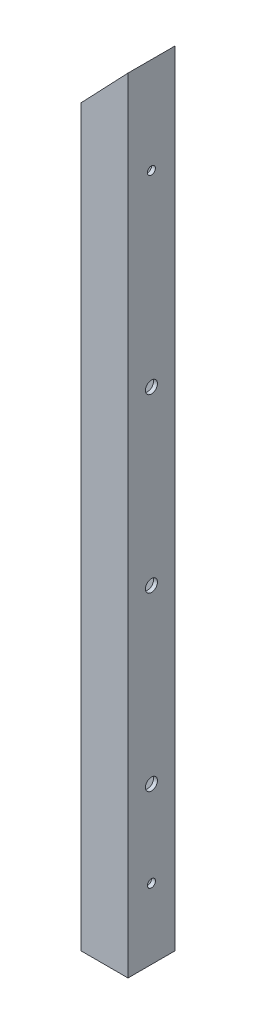
ISO-10303-21;
HEADER;
FILE_DESCRIPTION(('STEP AP214'),'2;1');
FILE_NAME('part.step','',(''),(''),'','','');
FILE_SCHEMA(('AUTOMOTIVE_DESIGN { 1 0 10303 214 1 1 1 1 }'));
ENDSEC;
DATA;
#1=APPLICATION_CONTEXT('core data for automotive mechanical design processes');
#2=APPLICATION_PROTOCOL_DEFINITION('international standard','automotive_design',2000,#1);
#3=PRODUCT_CONTEXT('',#1,'mechanical');
#4=PRODUCT('Part','Part','',(#3));
#5=PRODUCT_RELATED_PRODUCT_CATEGORY('part','',(#4));
#6=PRODUCT_DEFINITION_FORMATION('','',#4);
#7=PRODUCT_DEFINITION_CONTEXT('part definition',#1,'design');
#8=PRODUCT_DEFINITION('design','',#6,#7);
#9=PRODUCT_DEFINITION_SHAPE('','',#8);
#10=(LENGTH_UNIT() NAMED_UNIT(*) SI_UNIT(.MILLI.,.METRE.));
#11=(NAMED_UNIT(*) PLANE_ANGLE_UNIT() SI_UNIT($,.RADIAN.));
#12=(NAMED_UNIT(*) SI_UNIT($,.STERADIAN.) SOLID_ANGLE_UNIT());
#13=UNCERTAINTY_MEASURE_WITH_UNIT(LENGTH_MEASURE(1.E-05),#10,'distance_accuracy_value','');
#14=(GEOMETRIC_REPRESENTATION_CONTEXT(3) GLOBAL_UNCERTAINTY_ASSIGNED_CONTEXT((#13)) GLOBAL_UNIT_ASSIGNED_CONTEXT((#10,
#11,#12)) REPRESENTATION_CONTEXT('',''));
#15=CARTESIAN_POINT('',(0.,0.,0.));
#16=DIRECTION('',(0.,0.,1.));
#17=DIRECTION('',(1.,0.,0.));
#18=AXIS2_PLACEMENT_3D('',#15,#16,#17);
#19=CARTESIAN_POINT('',(-698.5,596.9,-38.1));
#20=DIRECTION('',(1.,0.,0.));
#21=DIRECTION('',(0.,1.,0.));
#22=AXIS2_PLACEMENT_3D('',#19,#20,#21);
#23=PLANE('',#22);
#24=CARTESIAN_POINT('',(-698.5,57.15,-19.05));
#25=DIRECTION('',(1.,0.,0.));
#26=DIRECTION('',(0.,0.,-1.));
#27=AXIS2_PLACEMENT_3D('',#24,#25,#26);
#28=CIRCLE('',#27,3.26389999999966);
#29=CARTESIAN_POINT('',(-698.5,57.15,-22.3138999999997));
#30=VERTEX_POINT('',#29);
#31=EDGE_CURVE('E253',#30,#30,#28,.T.);
#32=ORIENTED_EDGE('',*,*,#31,.T.);
#33=EDGE_LOOP('',(#32));
#34=FACE_BOUND('',#33,.T.);
#35=CARTESIAN_POINT('',(-698.5,558.8,-19.05));
#36=DIRECTION('',(1.,0.,0.));
#37=DIRECTION('',(0.,0.,-1.));
#38=AXIS2_PLACEMENT_3D('',#35,#36,#37);
#39=CIRCLE('',#38,3.26389999999965);
#40=CARTESIAN_POINT('',(-698.5,558.8,-22.3138999999997));
#41=VERTEX_POINT('',#40);
#42=EDGE_CURVE('E151',#41,#41,#39,.T.);
#43=ORIENTED_EDGE('',*,*,#42,.T.);
#44=EDGE_LOOP('',(#43));
#45=FACE_BOUND('',#44,.T.);
#46=CARTESIAN_POINT('',(-698.5,127.,-19.05));
#47=DIRECTION('',(1.,0.,0.));
#48=DIRECTION('',(0.,0.,-1.));
#49=AXIS2_PLACEMENT_3D('',#46,#47,#48);
#50=CIRCLE('',#49,4.90219999999966);
#51=CARTESIAN_POINT('',(-698.5,127.,-23.9521999999997));
#52=VERTEX_POINT('',#51);
#53=EDGE_CURVE('E169',#52,#52,#50,.T.);
#54=ORIENTED_EDGE('',*,*,#53,.T.);
#55=EDGE_LOOP('',(#54));
#56=FACE_BOUND('',#55,.T.);
#57=CARTESIAN_POINT('',(-698.5,406.4,-19.05));
#58=DIRECTION('',(1.,0.,0.));
#59=DIRECTION('',(0.,0.,-1.));
#60=AXIS2_PLACEMENT_3D('',#57,#58,#59);
#61=CIRCLE('',#60,4.90219999999963);
#62=CARTESIAN_POINT('',(-698.5,406.4,-23.9521999999996));
#63=VERTEX_POINT('',#62);
#64=EDGE_CURVE('E147',#63,#63,#61,.T.);
#65=ORIENTED_EDGE('',*,*,#64,.T.);
#66=EDGE_LOOP('',(#65));
#67=FACE_BOUND('',#66,.T.);
#68=CARTESIAN_POINT('',(-698.5,266.7,-19.05));
#69=DIRECTION('',(1.,0.,0.));
#70=DIRECTION('',(0.,0.,-1.));
#71=AXIS2_PLACEMENT_3D('',#68,#69,#70);
#72=CIRCLE('',#71,4.90219999999963);
#73=CARTESIAN_POINT('',(-698.5,266.7,-23.9521999999996));
#74=VERTEX_POINT('',#73);
#75=EDGE_CURVE('E143',#74,#74,#72,.T.);
#76=ORIENTED_EDGE('',*,*,#75,.T.);
#77=EDGE_LOOP('',(#76));
#78=FACE_BOUND('',#77,.T.);
#79=DIRECTION('',(0.,0.,-1.));
#80=VECTOR('',#79,1.);
#81=CARTESIAN_POINT('',(-698.5,-2.22044604925031E-13,-38.1));
#82=LINE('',#81,#80);
#83=CARTESIAN_POINT('',(-698.5,-2.22044604925031E-13,0.));
#84=VERTEX_POINT('',#83);
#85=CARTESIAN_POINT('',(-698.5,-2.22044604925031E-13,-38.1));
#86=VERTEX_POINT('',#85);
#87=EDGE_CURVE('E112',#84,#86,#82,.T.);
#88=ORIENTED_EDGE('',*,*,#87,.F.);
#89=DIRECTION('',(0.,-1.,0.));
#90=VECTOR('',#89,1.);
#91=CARTESIAN_POINT('',(-698.5,596.9,0.));
#92=LINE('',#91,#90);
#93=CARTESIAN_POINT('',(-698.5,596.9,0.));
#94=VERTEX_POINT('',#93);
#95=EDGE_CURVE('E49',#94,#84,#92,.T.);
#96=ORIENTED_EDGE('',*,*,#95,.F.);
#97=DIRECTION('',(0.,0.,1.));
#98=VECTOR('',#97,1.);
#99=CARTESIAN_POINT('',(-698.5,596.9,-38.1));
#100=LINE('',#99,#98);
#101=CARTESIAN_POINT('',(-698.5,596.9,-38.1));
#102=VERTEX_POINT('',#101);
#103=EDGE_CURVE('E124',#102,#94,#100,.T.);
#104=ORIENTED_EDGE('',*,*,#103,.F.);
#105=DIRECTION('',(0.,-1.,0.));
#106=VECTOR('',#105,1.);
#107=CARTESIAN_POINT('',(-698.5,596.9,-38.1));
#108=LINE('',#107,#106);
#109=EDGE_CURVE('E131',#102,#86,#108,.T.);
#110=ORIENTED_EDGE('',*,*,#109,.T.);
#111=EDGE_LOOP('',(#88,#96,#104,#110));
#112=FACE_BOUND('',#111,.T.);
#113=ADVANCED_FACE('F33',(#34,#45,#56,#67,#78,#112),#23,.F.);
#114=CARTESIAN_POINT('',(-660.4,596.9,0.));
#115=DIRECTION('',(0.,0.,-1.));
#116=DIRECTION('',(-1.,0.,0.));
#117=AXIS2_PLACEMENT_3D('',#114,#115,#116);
#118=PLANE('',#117);
#119=DIRECTION('',(-1.,0.,0.));
#120=VECTOR('',#119,1.);
#121=CARTESIAN_POINT('',(-660.4,-2.22044604925031E-13,0.));
#122=LINE('',#121,#120);
#123=CARTESIAN_POINT('',(-660.4,-2.22044604925031E-13,0.));
#124=VERTEX_POINT('',#123);
#125=EDGE_CURVE('E199',#124,#84,#122,.T.);
#126=ORIENTED_EDGE('',*,*,#125,.F.);
#127=DIRECTION('',(0.,-1.,0.));
#128=VECTOR('',#127,1.);
#129=CARTESIAN_POINT('',(-660.4,596.9,0.));
#130=LINE('',#129,#128);
#131=CARTESIAN_POINT('',(-660.4,636.843548387097,0.));
#132=VERTEX_POINT('',#131);
#133=EDGE_CURVE('E121',#132,#124,#130,.T.);
#134=ORIENTED_EDGE('',*,*,#133,.F.);
#135=DIRECTION('',(0.690210929016375,0.723608232033296,0.));
#136=VECTOR('',#135,1.);
#137=CARTESIAN_POINT('',(-680.349498079068,615.92875201388,0.));
#138=LINE('',#137,#136);
#139=EDGE_CURVE('E220',#94,#132,#138,.T.);
#140=ORIENTED_EDGE('',*,*,#139,.F.);
#141=ORIENTED_EDGE('',*,*,#95,.T.);
#142=EDGE_LOOP('',(#126,#134,#140,#141));
#143=FACE_BOUND('',#142,.T.);
#144=ADVANCED_FACE('F230',(#143),#118,.F.);
#145=CARTESIAN_POINT('',(-660.4,596.9,-38.1));
#146=DIRECTION('',(-1.,0.,0.));
#147=DIRECTION('',(0.,-1.,0.));
#148=AXIS2_PLACEMENT_3D('',#145,#146,#147);
#149=PLANE('',#148);
#150=CARTESIAN_POINT('',(-660.4,57.15,-19.05));
#151=DIRECTION('',(-1.,0.,0.));
#152=DIRECTION('',(0.,-1.,0.));
#153=AXIS2_PLACEMENT_3D('',#150,#151,#152);
#154=CIRCLE('',#153,3.26389999999974);
#155=CARTESIAN_POINT('',(-660.4,53.8861000000003,-19.05));
#156=VERTEX_POINT('',#155);
#157=EDGE_CURVE('E36',#156,#156,#154,.T.);
#158=ORIENTED_EDGE('',*,*,#157,.T.);
#159=EDGE_LOOP('',(#158));
#160=FACE_BOUND('',#159,.T.);
#161=CARTESIAN_POINT('',(-660.4,558.8,-19.05));
#162=DIRECTION('',(-1.,0.,0.));
#163=DIRECTION('',(0.,-1.,0.));
#164=AXIS2_PLACEMENT_3D('',#161,#162,#163);
#165=CIRCLE('',#164,3.26389999999976);
#166=CARTESIAN_POINT('',(-660.4,555.5361,-19.05));
#167=VERTEX_POINT('',#166);
#168=EDGE_CURVE('E155',#167,#167,#165,.T.);
#169=ORIENTED_EDGE('',*,*,#168,.T.);
#170=EDGE_LOOP('',(#169));
#171=FACE_BOUND('',#170,.T.);
#172=CARTESIAN_POINT('',(-660.4,127.,-19.05));
#173=DIRECTION('',(-1.,0.,0.));
#174=DIRECTION('',(0.,-1.,0.));
#175=AXIS2_PLACEMENT_3D('',#172,#173,#174);
#176=CIRCLE('',#175,4.90219999999975);
#177=CARTESIAN_POINT('',(-660.4,122.0978,-19.05));
#178=VERTEX_POINT('',#177);
#179=EDGE_CURVE('E172',#178,#178,#176,.T.);
#180=ORIENTED_EDGE('',*,*,#179,.T.);
#181=EDGE_LOOP('',(#180));
#182=FACE_BOUND('',#181,.T.);
#183=CARTESIAN_POINT('',(-660.4,406.4,-19.05));
#184=DIRECTION('',(-1.,0.,0.));
#185=DIRECTION('',(0.,-1.,0.));
#186=AXIS2_PLACEMENT_3D('',#183,#184,#185);
#187=CIRCLE('',#186,4.90219999999975);
#188=CARTESIAN_POINT('',(-660.4,401.4978,-19.05));
#189=VERTEX_POINT('',#188);
#190=EDGE_CURVE('E185',#189,#189,#187,.T.);
#191=ORIENTED_EDGE('',*,*,#190,.T.);
#192=EDGE_LOOP('',(#191));
#193=FACE_BOUND('',#192,.T.);
#194=CARTESIAN_POINT('',(-660.4,266.7,-19.05));
#195=DIRECTION('',(-1.,0.,0.));
#196=DIRECTION('',(0.,-1.,0.));
#197=AXIS2_PLACEMENT_3D('',#194,#195,#196);
#198=CIRCLE('',#197,4.90219999999972);
#199=CARTESIAN_POINT('',(-660.4,261.7978,-19.05));
#200=VERTEX_POINT('',#199);
#201=EDGE_CURVE('E192',#200,#200,#198,.T.);
#202=ORIENTED_EDGE('',*,*,#201,.T.);
#203=EDGE_LOOP('',(#202));
#204=FACE_BOUND('',#203,.T.);
#205=DIRECTION('',(0.,0.,1.));
#206=VECTOR('',#205,1.);
#207=CARTESIAN_POINT('',(-660.4,-2.22044604925031E-13,-38.1));
#208=LINE('',#207,#206);
#209=CARTESIAN_POINT('',(-660.4,-2.22044604925031E-13,-38.1));
#210=VERTEX_POINT('',#209);
#211=EDGE_CURVE('E202',#210,#124,#208,.T.);
#212=ORIENTED_EDGE('',*,*,#211,.F.);
#213=DIRECTION('',(0.,-1.,0.));
#214=VECTOR('',#213,1.);
#215=CARTESIAN_POINT('',(-660.4,596.9,-38.1));
#216=LINE('',#215,#214);
#217=CARTESIAN_POINT('',(-660.4,636.843548387097,-38.1));
#218=VERTEX_POINT('',#217);
#219=EDGE_CURVE('E133',#218,#210,#216,.T.);
#220=ORIENTED_EDGE('',*,*,#219,.F.);
#221=DIRECTION('',(0.,0.,-1.));
#222=VECTOR('',#221,1.);
#223=CARTESIAN_POINT('',(-660.4,636.843548387097,-38.1));
#224=LINE('',#223,#222);
#225=EDGE_CURVE('E218',#132,#218,#224,.T.);
#226=ORIENTED_EDGE('',*,*,#225,.F.);
#227=ORIENTED_EDGE('',*,*,#133,.T.);
#228=EDGE_LOOP('',(#212,#220,#226,#227));
#229=FACE_BOUND('',#228,.T.);
#230=ADVANCED_FACE('F232',(#160,#171,#182,#193,#204,#229),#149,.F.);
#231=CARTESIAN_POINT('',(-660.4,596.9,-38.1));
#232=DIRECTION('',(0.,0.,1.));
#233=DIRECTION('',(1.,0.,0.));
#234=AXIS2_PLACEMENT_3D('',#231,#232,#233);
#235=PLANE('',#234);
#236=DIRECTION('',(1.,0.,0.));
#237=VECTOR('',#236,1.);
#238=CARTESIAN_POINT('',(-660.4,-2.22044604925031E-13,-38.1));
#239=LINE('',#238,#237);
#240=EDGE_CURVE('E205',#86,#210,#239,.T.);
#241=ORIENTED_EDGE('',*,*,#240,.F.);
#242=ORIENTED_EDGE('',*,*,#109,.F.);
#243=DIRECTION('',(-0.690210929016375,-0.723608232033296,0.));
#244=VECTOR('',#243,1.);
#245=CARTESIAN_POINT('',(-680.349498079068,615.92875201388,-38.1));
#246=LINE('',#245,#244);
#247=EDGE_CURVE('E215',#218,#102,#246,.T.);
#248=ORIENTED_EDGE('',*,*,#247,.F.);
#249=ORIENTED_EDGE('',*,*,#219,.T.);
#250=EDGE_LOOP('',(#241,#242,#248,#249));
#251=FACE_BOUND('',#250,.T.);
#252=ADVANCED_FACE('F234',(#251),#235,.F.);
#253=CARTESIAN_POINT('',(-698.5,596.9,-38.1));
#254=DIRECTION('',(-0.723608232033296,0.690210929016375,0.));
#255=DIRECTION('',(-0.690210929016375,-0.723608232033296,0.));
#256=AXIS2_PLACEMENT_3D('',#253,#254,#255);
#257=PLANE('',#256);
#258=DIRECTION('',(0.,0.,1.));
#259=VECTOR('',#258,1.);
#260=CARTESIAN_POINT('',(-695.325,600.228629032258,-34.925));
#261=LINE('',#260,#259);
#262=CARTESIAN_POINT('',(-695.325,600.228629032258,-34.925));
#263=VERTEX_POINT('',#262);
#264=CARTESIAN_POINT('',(-695.325,600.228629032258,-3.175));
#265=VERTEX_POINT('',#264);
#266=EDGE_CURVE('E117',#263,#265,#261,.T.);
#267=ORIENTED_EDGE('',*,*,#266,.F.);
#268=DIRECTION('',(-0.690210929016375,-0.723608232033296,0.));
#269=VECTOR('',#268,1.);
#270=CARTESIAN_POINT('',(-681.862039905812,614.34302267939,-34.925));
#271=LINE('',#270,#269);
#272=CARTESIAN_POINT('',(-663.575,633.514919354839,-34.925));
#273=VERTEX_POINT('',#272);
#274=EDGE_CURVE('E211',#273,#263,#271,.T.);
#275=ORIENTED_EDGE('',*,*,#274,.F.);
#276=DIRECTION('',(0.,0.,-1.));
#277=VECTOR('',#276,1.);
#278=CARTESIAN_POINT('',(-663.575,633.514919354839,-34.925));
#279=LINE('',#278,#277);
#280=CARTESIAN_POINT('',(-663.575,633.514919354839,-3.175));
#281=VERTEX_POINT('',#280);
#282=EDGE_CURVE('E208',#281,#273,#279,.T.);
#283=ORIENTED_EDGE('',*,*,#282,.F.);
#284=DIRECTION('',(0.690210929016375,0.723608232033296,0.));
#285=VECTOR('',#284,1.);
#286=CARTESIAN_POINT('',(-681.862039905812,614.34302267939,-3.175));
#287=LINE('',#286,#285);
#288=EDGE_CURVE('E41',#265,#281,#287,.T.);
#289=ORIENTED_EDGE('',*,*,#288,.F.);
#290=EDGE_LOOP('',(#267,#275,#283,#289));
#291=FACE_BOUND('',#290,.T.);
#292=ORIENTED_EDGE('',*,*,#247,.T.);
#293=ORIENTED_EDGE('',*,*,#103,.T.);
#294=ORIENTED_EDGE('',*,*,#139,.T.);
#295=ORIENTED_EDGE('',*,*,#225,.T.);
#296=EDGE_LOOP('',(#292,#293,#294,#295));
#297=FACE_BOUND('',#296,.T.);
#298=ADVANCED_FACE('F225',(#291,#297),#257,.T.);
#299=CARTESIAN_POINT('',(-695.325,596.9,-34.925));
#300=DIRECTION('',(1.,0.,0.));
#301=DIRECTION('',(0.,1.,0.));
#302=AXIS2_PLACEMENT_3D('',#299,#300,#301);
#303=PLANE('',#302);
#304=CARTESIAN_POINT('',(-695.325,57.15,-19.05));
#305=DIRECTION('',(1.,0.,0.));
#306=DIRECTION('',(0.,1.,0.));
#307=AXIS2_PLACEMENT_3D('',#304,#305,#306);
#308=CIRCLE('',#307,3.26389999999974);
#309=CARTESIAN_POINT('',(-695.325,60.4138999999997,-19.05));
#310=VERTEX_POINT('',#309);
#311=EDGE_CURVE('E163',#310,#310,#308,.T.);
#312=ORIENTED_EDGE('',*,*,#311,.F.);
#313=EDGE_LOOP('',(#312));
#314=FACE_BOUND('',#313,.T.);
#315=CARTESIAN_POINT('',(-695.325,558.8,-19.05));
#316=DIRECTION('',(1.,0.,0.));
#317=DIRECTION('',(0.,1.,0.));
#318=AXIS2_PLACEMENT_3D('',#315,#316,#317);
#319=CIRCLE('',#318,3.26389999999976);
#320=CARTESIAN_POINT('',(-695.325,562.0639,-19.05));
#321=VERTEX_POINT('',#320);
#322=EDGE_CURVE('E150',#321,#321,#319,.T.);
#323=ORIENTED_EDGE('',*,*,#322,.F.);
#324=EDGE_LOOP('',(#323));
#325=FACE_BOUND('',#324,.T.);
#326=CARTESIAN_POINT('',(-695.325,127.,-19.05));
#327=DIRECTION('',(1.,0.,0.));
#328=DIRECTION('',(0.,1.,0.));
#329=AXIS2_PLACEMENT_3D('',#326,#327,#328);
#330=CIRCLE('',#329,4.90219999999975);
#331=CARTESIAN_POINT('',(-695.325,131.9022,-19.05));
#332=VERTEX_POINT('',#331);
#333=EDGE_CURVE('E175',#332,#332,#330,.T.);
#334=ORIENTED_EDGE('',*,*,#333,.F.);
#335=EDGE_LOOP('',(#334));
#336=FACE_BOUND('',#335,.T.);
#337=CARTESIAN_POINT('',(-695.325,406.4,-19.05));
#338=DIRECTION('',(1.,0.,0.));
#339=DIRECTION('',(0.,1.,0.));
#340=AXIS2_PLACEMENT_3D('',#337,#338,#339);
#341=CIRCLE('',#340,4.90219999999975);
#342=CARTESIAN_POINT('',(-695.325,411.3022,-19.05));
#343=VERTEX_POINT('',#342);
#344=EDGE_CURVE('E146',#343,#343,#341,.T.);
#345=ORIENTED_EDGE('',*,*,#344,.F.);
#346=EDGE_LOOP('',(#345));
#347=FACE_BOUND('',#346,.T.);
#348=CARTESIAN_POINT('',(-695.325,266.7,-19.05));
#349=DIRECTION('',(1.,0.,0.));
#350=DIRECTION('',(0.,1.,0.));
#351=AXIS2_PLACEMENT_3D('',#348,#349,#350);
#352=CIRCLE('',#351,4.90219999999972);
#353=CARTESIAN_POINT('',(-695.325,271.6022,-19.05));
#354=VERTEX_POINT('',#353);
#355=EDGE_CURVE('E142',#354,#354,#352,.T.);
#356=ORIENTED_EDGE('',*,*,#355,.F.);
#357=EDGE_LOOP('',(#356));
#358=FACE_BOUND('',#357,.T.);
#359=DIRECTION('',(0.,-1.,0.));
#360=VECTOR('',#359,1.);
#361=CARTESIAN_POINT('',(-695.325,596.9,-3.175));
#362=LINE('',#361,#360);
#363=CARTESIAN_POINT('',(-695.325,-2.22044604925031E-13,-3.175));
#364=VERTEX_POINT('',#363);
#365=EDGE_CURVE('E108',#265,#364,#362,.T.);
#366=ORIENTED_EDGE('',*,*,#365,.T.);
#367=DIRECTION('',(0.,0.,-1.));
#368=VECTOR('',#367,1.);
#369=CARTESIAN_POINT('',(-695.325,-2.22044604925031E-13,-34.925));
#370=LINE('',#369,#368);
#371=CARTESIAN_POINT('',(-695.325,-2.22044604925031E-13,-34.925));
#372=VERTEX_POINT('',#371);
#373=EDGE_CURVE('E11',#364,#372,#370,.T.);
#374=ORIENTED_EDGE('',*,*,#373,.T.);
#375=DIRECTION('',(0.,-1.,0.));
#376=VECTOR('',#375,1.);
#377=CARTESIAN_POINT('',(-695.325,596.9,-34.925));
#378=LINE('',#377,#376);
#379=EDGE_CURVE('E129',#263,#372,#378,.T.);
#380=ORIENTED_EDGE('',*,*,#379,.F.);
#381=ORIENTED_EDGE('',*,*,#266,.T.);
#382=EDGE_LOOP('',(#366,#374,#380,#381));
#383=FACE_BOUND('',#382,.T.);
#384=ADVANCED_FACE('F116',(#314,#325,#336,#347,#358,#383),#303,.T.);
#385=CARTESIAN_POINT('',(-663.575,596.9,-34.925));
#386=DIRECTION('',(0.,0.,1.));
#387=DIRECTION('',(1.,0.,0.));
#388=AXIS2_PLACEMENT_3D('',#385,#386,#387);
#389=PLANE('',#388);
#390=ORIENTED_EDGE('',*,*,#379,.T.);
#391=DIRECTION('',(1.,0.,0.));
#392=VECTOR('',#391,1.);
#393=CARTESIAN_POINT('',(-663.575,-2.22044604925031E-13,-34.925));
#394=LINE('',#393,#392);
#395=CARTESIAN_POINT('',(-663.575,-2.22044604925031E-13,-34.925));
#396=VERTEX_POINT('',#395);
#397=EDGE_CURVE('E57',#372,#396,#394,.T.);
#398=ORIENTED_EDGE('',*,*,#397,.T.);
#399=DIRECTION('',(0.,-1.,0.));
#400=VECTOR('',#399,1.);
#401=CARTESIAN_POINT('',(-663.575,596.9,-34.925));
#402=LINE('',#401,#400);
#403=EDGE_CURVE('E119',#273,#396,#402,.T.);
#404=ORIENTED_EDGE('',*,*,#403,.F.);
#405=ORIENTED_EDGE('',*,*,#274,.T.);
#406=EDGE_LOOP('',(#390,#398,#404,#405));
#407=FACE_BOUND('',#406,.T.);
#408=ADVANCED_FACE('F284',(#407),#389,.T.);
#409=CARTESIAN_POINT('',(-663.575,596.9,-34.925));
#410=DIRECTION('',(-1.,0.,0.));
#411=DIRECTION('',(0.,-1.,0.));
#412=AXIS2_PLACEMENT_3D('',#409,#410,#411);
#413=PLANE('',#412);
#414=CARTESIAN_POINT('',(-663.575,57.15,-19.05));
#415=DIRECTION('',(-1.,0.,0.));
#416=DIRECTION('',(0.,-1.,0.));
#417=AXIS2_PLACEMENT_3D('',#414,#415,#416);
#418=CIRCLE('',#417,3.26389999999974);
#419=CARTESIAN_POINT('',(-663.575,53.8861000000003,-19.05));
#420=VERTEX_POINT('',#419);
#421=EDGE_CURVE('E158',#420,#420,#418,.T.);
#422=ORIENTED_EDGE('',*,*,#421,.F.);
#423=EDGE_LOOP('',(#422));
#424=FACE_BOUND('',#423,.T.);
#425=CARTESIAN_POINT('',(-663.575,558.8,-19.05));
#426=DIRECTION('',(-1.,0.,0.));
#427=DIRECTION('',(0.,-1.,0.));
#428=AXIS2_PLACEMENT_3D('',#425,#426,#427);
#429=CIRCLE('',#428,3.26389999999976);
#430=CARTESIAN_POINT('',(-663.575,555.5361,-19.05));
#431=VERTEX_POINT('',#430);
#432=EDGE_CURVE('E148',#431,#431,#429,.T.);
#433=ORIENTED_EDGE('',*,*,#432,.F.);
#434=EDGE_LOOP('',(#433));
#435=FACE_BOUND('',#434,.T.);
#436=CARTESIAN_POINT('',(-663.575,127.,-19.05));
#437=DIRECTION('',(-1.,0.,0.));
#438=DIRECTION('',(0.,-1.,0.));
#439=AXIS2_PLACEMENT_3D('',#436,#437,#438);
#440=CIRCLE('',#439,4.90219999999975);
#441=CARTESIAN_POINT('',(-663.575,122.0978,-19.05));
#442=VERTEX_POINT('',#441);
#443=EDGE_CURVE('E178',#442,#442,#440,.T.);
#444=ORIENTED_EDGE('',*,*,#443,.F.);
#445=EDGE_LOOP('',(#444));
#446=FACE_BOUND('',#445,.T.);
#447=CARTESIAN_POINT('',(-663.575,406.4,-19.05));
#448=DIRECTION('',(-1.,0.,0.));
#449=DIRECTION('',(0.,-1.,0.));
#450=AXIS2_PLACEMENT_3D('',#447,#448,#449);
#451=CIRCLE('',#450,4.90219999999975);
#452=CARTESIAN_POINT('',(-663.575,401.4978,-19.05));
#453=VERTEX_POINT('',#452);
#454=EDGE_CURVE('E144',#453,#453,#451,.T.);
#455=ORIENTED_EDGE('',*,*,#454,.F.);
#456=EDGE_LOOP('',(#455));
#457=FACE_BOUND('',#456,.T.);
#458=CARTESIAN_POINT('',(-663.575,266.7,-19.05));
#459=DIRECTION('',(-1.,0.,0.));
#460=DIRECTION('',(0.,-1.,0.));
#461=AXIS2_PLACEMENT_3D('',#458,#459,#460);
#462=CIRCLE('',#461,4.90219999999972);
#463=CARTESIAN_POINT('',(-663.575,261.7978,-19.05));
#464=VERTEX_POINT('',#463);
#465=EDGE_CURVE('E139',#464,#464,#462,.T.);
#466=ORIENTED_EDGE('',*,*,#465,.F.);
#467=EDGE_LOOP('',(#466));
#468=FACE_BOUND('',#467,.T.);
#469=ORIENTED_EDGE('',*,*,#403,.T.);
#470=DIRECTION('',(0.,0.,1.));
#471=VECTOR('',#470,1.);
#472=CARTESIAN_POINT('',(-663.575,-2.22044604925031E-13,-34.925));
#473=LINE('',#472,#471);
#474=CARTESIAN_POINT('',(-663.575,-2.22044604925031E-13,-3.175));
#475=VERTEX_POINT('',#474);
#476=EDGE_CURVE('E113',#396,#475,#473,.T.);
#477=ORIENTED_EDGE('',*,*,#476,.T.);
#478=DIRECTION('',(0.,-1.,0.));
#479=VECTOR('',#478,1.);
#480=CARTESIAN_POINT('',(-663.575,596.9,-3.175));
#481=LINE('',#480,#479);
#482=EDGE_CURVE('E110',#281,#475,#481,.T.);
#483=ORIENTED_EDGE('',*,*,#482,.F.);
#484=ORIENTED_EDGE('',*,*,#282,.T.);
#485=EDGE_LOOP('',(#469,#477,#483,#484));
#486=FACE_BOUND('',#485,.T.);
#487=ADVANCED_FACE('F281',(#424,#435,#446,#457,#468,#486),#413,.T.);
#488=CARTESIAN_POINT('',(-663.575,596.9,-3.175));
#489=DIRECTION('',(0.,0.,-1.));
#490=DIRECTION('',(-1.,0.,0.));
#491=AXIS2_PLACEMENT_3D('',#488,#489,#490);
#492=PLANE('',#491);
#493=ORIENTED_EDGE('',*,*,#482,.T.);
#494=DIRECTION('',(-1.,0.,0.));
#495=VECTOR('',#494,1.);
#496=CARTESIAN_POINT('',(-663.575,-2.22044604925031E-13,-3.175));
#497=LINE('',#496,#495);
#498=EDGE_CURVE('E99',#475,#364,#497,.T.);
#499=ORIENTED_EDGE('',*,*,#498,.T.);
#500=ORIENTED_EDGE('',*,*,#365,.F.);
#501=ORIENTED_EDGE('',*,*,#288,.T.);
#502=EDGE_LOOP('',(#493,#499,#500,#501));
#503=FACE_BOUND('',#502,.T.);
#504=ADVANCED_FACE('F106',(#503),#492,.T.);
#505=CARTESIAN_POINT('',(-698.5,-2.22044604925031E-13,0.));
#506=DIRECTION('',(0.,-1.,0.));
#507=DIRECTION('',(1.,0.,0.));
#508=AXIS2_PLACEMENT_3D('',#505,#506,#507);
#509=PLANE('',#508);
#510=ORIENTED_EDGE('',*,*,#498,.F.);
#511=ORIENTED_EDGE('',*,*,#476,.F.);
#512=ORIENTED_EDGE('',*,*,#397,.F.);
#513=ORIENTED_EDGE('',*,*,#373,.F.);
#514=EDGE_LOOP('',(#510,#511,#512,#513));
#515=FACE_BOUND('',#514,.T.);
#516=ORIENTED_EDGE('',*,*,#87,.T.);
#517=ORIENTED_EDGE('',*,*,#240,.T.);
#518=ORIENTED_EDGE('',*,*,#211,.T.);
#519=ORIENTED_EDGE('',*,*,#125,.T.);
#520=EDGE_LOOP('',(#516,#517,#518,#519));
#521=FACE_BOUND('',#520,.T.);
#522=ADVANCED_FACE('F97',(#515,#521),#509,.T.);
#523=CARTESIAN_POINT('',(698.5,266.7,-19.05));
#524=DIRECTION('',(1.,0.,0.));
#525=DIRECTION('',(0.,0.,-1.));
#526=AXIS2_PLACEMENT_3D('',#523,#524,#525);
#527=CYLINDRICAL_SURFACE('',#526,4.90219999999972);
#528=ORIENTED_EDGE('',*,*,#465,.T.);
#529=EDGE_LOOP('',(#528));
#530=FACE_BOUND('',#529,.T.);
#531=ORIENTED_EDGE('',*,*,#201,.F.);
#532=EDGE_LOOP('',(#531));
#533=FACE_BOUND('',#532,.T.);
#534=ADVANCED_FACE('F264',(#530,#533),#527,.F.);
#535=ORIENTED_EDGE('',*,*,#355,.T.);
#536=EDGE_LOOP('',(#535));
#537=FACE_BOUND('',#536,.T.);
#538=ORIENTED_EDGE('',*,*,#75,.F.);
#539=EDGE_LOOP('',(#538));
#540=FACE_BOUND('',#539,.T.);
#541=ADVANCED_FACE('F261',(#537,#540),#527,.F.);
#542=CARTESIAN_POINT('',(698.5,406.4,-19.05));
#543=DIRECTION('',(1.,0.,0.));
#544=DIRECTION('',(0.,0.,-1.));
#545=AXIS2_PLACEMENT_3D('',#542,#543,#544);
#546=CYLINDRICAL_SURFACE('',#545,4.90219999999975);
#547=ORIENTED_EDGE('',*,*,#454,.T.);
#548=EDGE_LOOP('',(#547));
#549=FACE_BOUND('',#548,.T.);
#550=ORIENTED_EDGE('',*,*,#190,.F.);
#551=EDGE_LOOP('',(#550));
#552=FACE_BOUND('',#551,.T.);
#553=ADVANCED_FACE('F263',(#549,#552),#546,.F.);
#554=ORIENTED_EDGE('',*,*,#344,.T.);
#555=EDGE_LOOP('',(#554));
#556=FACE_BOUND('',#555,.T.);
#557=ORIENTED_EDGE('',*,*,#64,.F.);
#558=EDGE_LOOP('',(#557));
#559=FACE_BOUND('',#558,.T.);
#560=ADVANCED_FACE('F271',(#556,#559),#546,.F.);
#561=CARTESIAN_POINT('',(698.5,127.,-19.05));
#562=DIRECTION('',(1.,0.,0.));
#563=DIRECTION('',(0.,0.,-1.));
#564=AXIS2_PLACEMENT_3D('',#561,#562,#563);
#565=CYLINDRICAL_SURFACE('',#564,4.90219999999975);
#566=ORIENTED_EDGE('',*,*,#333,.T.);
#567=EDGE_LOOP('',(#566));
#568=FACE_BOUND('',#567,.T.);
#569=ORIENTED_EDGE('',*,*,#53,.F.);
#570=EDGE_LOOP('',(#569));
#571=FACE_BOUND('',#570,.T.);
#572=ADVANCED_FACE('F305',(#568,#571),#565,.F.);
#573=ORIENTED_EDGE('',*,*,#443,.T.);
#574=EDGE_LOOP('',(#573));
#575=FACE_BOUND('',#574,.T.);
#576=ORIENTED_EDGE('',*,*,#179,.F.);
#577=EDGE_LOOP('',(#576));
#578=FACE_BOUND('',#577,.T.);
#579=ADVANCED_FACE('F309',(#575,#578),#565,.F.);
#580=CARTESIAN_POINT('',(698.5,558.8,-19.05));
#581=DIRECTION('',(1.,0.,0.));
#582=DIRECTION('',(0.,0.,-1.));
#583=AXIS2_PLACEMENT_3D('',#580,#581,#582);
#584=CYLINDRICAL_SURFACE('',#583,3.26389999999976);
#585=ORIENTED_EDGE('',*,*,#432,.T.);
#586=EDGE_LOOP('',(#585));
#587=FACE_BOUND('',#586,.T.);
#588=ORIENTED_EDGE('',*,*,#168,.F.);
#589=EDGE_LOOP('',(#588));
#590=FACE_BOUND('',#589,.T.);
#591=ADVANCED_FACE('F314',(#587,#590),#584,.F.);
#592=ORIENTED_EDGE('',*,*,#322,.T.);
#593=EDGE_LOOP('',(#592));
#594=FACE_BOUND('',#593,.T.);
#595=ORIENTED_EDGE('',*,*,#42,.F.);
#596=EDGE_LOOP('',(#595));
#597=FACE_BOUND('',#596,.T.);
#598=ADVANCED_FACE('F320',(#594,#597),#584,.F.);
#599=CARTESIAN_POINT('',(698.5,57.15,-19.05));
#600=DIRECTION('',(1.,0.,0.));
#601=DIRECTION('',(0.,0.,-1.));
#602=AXIS2_PLACEMENT_3D('',#599,#600,#601);
#603=CYLINDRICAL_SURFACE('',#602,3.26389999999974);
#604=ORIENTED_EDGE('',*,*,#421,.T.);
#605=EDGE_LOOP('',(#604));
#606=FACE_BOUND('',#605,.T.);
#607=ORIENTED_EDGE('',*,*,#157,.F.);
#608=EDGE_LOOP('',(#607));
#609=FACE_BOUND('',#608,.T.);
#610=ADVANCED_FACE('F321',(#606,#609),#603,.F.);
#611=ORIENTED_EDGE('',*,*,#311,.T.);
#612=EDGE_LOOP('',(#611));
#613=FACE_BOUND('',#612,.T.);
#614=ORIENTED_EDGE('',*,*,#31,.F.);
#615=EDGE_LOOP('',(#614));
#616=FACE_BOUND('',#615,.T.);
#617=ADVANCED_FACE('F323',(#613,#616),#603,.F.);
#618=CLOSED_SHELL('',(#113,#144,#230,#252,#298,#384,#408,#487,#504,#522,#534,#541,#553,#560,
#572,#579,#591,#598,#610,#617));
#619=MANIFOLD_SOLID_BREP('B2',#618);
#620=ADVANCED_BREP_SHAPE_REPRESENTATION('',(#18,#619),#14);
#621=SHAPE_DEFINITION_REPRESENTATION(#9,#620);
ENDSEC;
END-ISO-10303-21;
